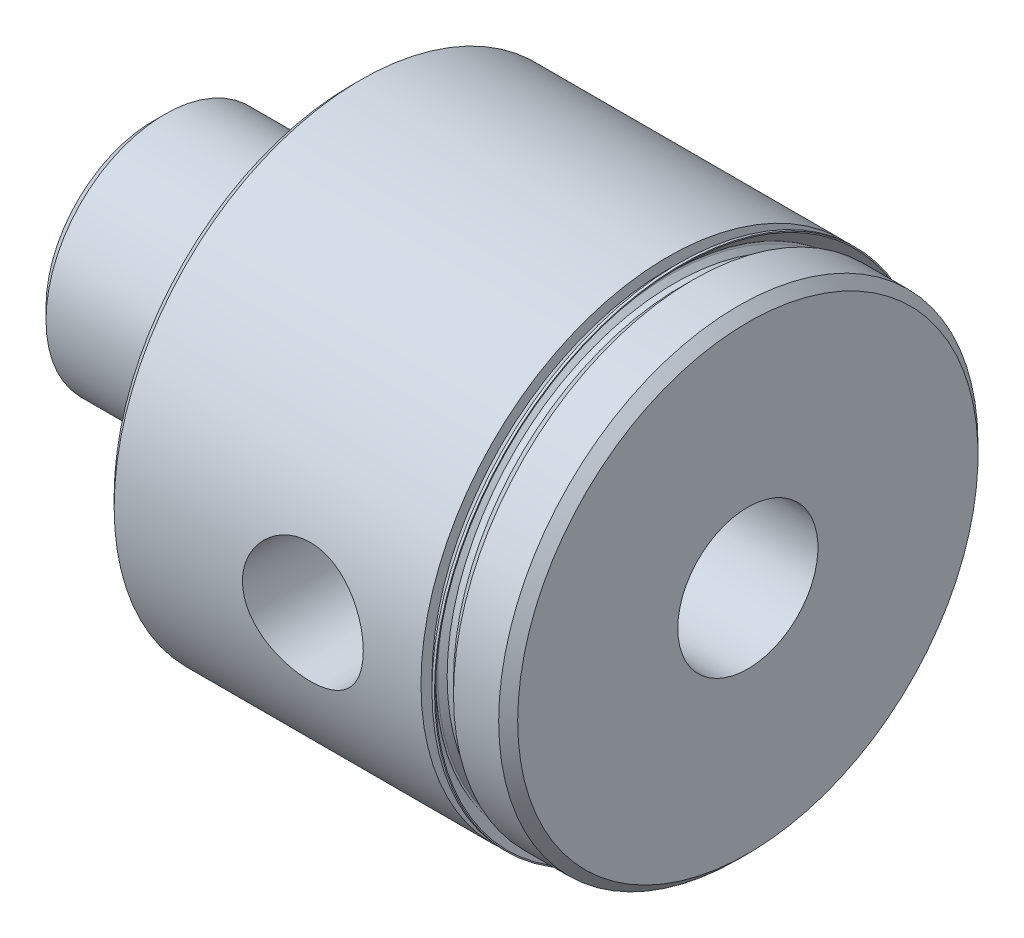
ISO-10303-21;
HEADER;
FILE_DESCRIPTION(('STEP AP214'),'2;1');
FILE_NAME('part.step','',(''),(''),'','','');
FILE_SCHEMA(('AUTOMOTIVE_DESIGN { 1 0 10303 214 1 1 1 1 }'));
ENDSEC;
DATA;
#1=APPLICATION_CONTEXT('core data for automotive mechanical design processes');
#2=APPLICATION_PROTOCOL_DEFINITION('international standard','automotive_design',2000,#1);
#3=PRODUCT_CONTEXT('',#1,'mechanical');
#4=PRODUCT('Part','Part','',(#3));
#5=PRODUCT_RELATED_PRODUCT_CATEGORY('part','',(#4));
#6=PRODUCT_DEFINITION_FORMATION('','',#4);
#7=PRODUCT_DEFINITION_CONTEXT('part definition',#1,'design');
#8=PRODUCT_DEFINITION('design','',#6,#7);
#9=PRODUCT_DEFINITION_SHAPE('','',#8);
#10=(LENGTH_UNIT() NAMED_UNIT(*) SI_UNIT(.MILLI.,.METRE.));
#11=(NAMED_UNIT(*) PLANE_ANGLE_UNIT() SI_UNIT($,.RADIAN.));
#12=(NAMED_UNIT(*) SI_UNIT($,.STERADIAN.) SOLID_ANGLE_UNIT());
#13=UNCERTAINTY_MEASURE_WITH_UNIT(LENGTH_MEASURE(1.E-05),#10,'distance_accuracy_value','');
#14=(GEOMETRIC_REPRESENTATION_CONTEXT(3) GLOBAL_UNCERTAINTY_ASSIGNED_CONTEXT((#13)) GLOBAL_UNIT_ASSIGNED_CONTEXT((#10,
#11,#12)) REPRESENTATION_CONTEXT('',''));
#15=CARTESIAN_POINT('',(0.,0.,0.));
#16=DIRECTION('',(0.,0.,1.));
#17=DIRECTION('',(1.,0.,0.));
#18=AXIS2_PLACEMENT_3D('',#15,#16,#17);
#19=CARTESIAN_POINT('',(41.2115,19.76755,0.));
#20=DIRECTION('',(-1.,0.,0.));
#21=DIRECTION('',(0.,0.,1.));
#22=AXIS2_PLACEMENT_3D('',#19,#20,#21);
#23=PLANE('',#22);
#24=CARTESIAN_POINT('',(41.2115,0.,0.));
#25=DIRECTION('',(-1.,0.,0.));
#26=DIRECTION('',(0.,0.,1.));
#27=AXIS2_PLACEMENT_3D('',#24,#25,#26);
#28=CIRCLE('',#27,19.76755);
#29=CARTESIAN_POINT('',(41.2115,0.,19.76755));
#30=VERTEX_POINT('',#29);
#31=EDGE_CURVE('E123',#30,#30,#28,.T.);
#32=ORIENTED_EDGE('',*,*,#31,.F.);
#33=EDGE_LOOP('',(#32));
#34=FACE_BOUND('',#33,.T.);
#35=CARTESIAN_POINT('',(41.2115,0.,0.));
#36=DIRECTION('',(-1.,0.,0.));
#37=DIRECTION('',(0.,0.,1.));
#38=AXIS2_PLACEMENT_3D('',#35,#36,#37);
#39=CIRCLE('',#38,18.888259175245);
#40=CARTESIAN_POINT('',(41.2115,0.,18.888259175245));
#41=VERTEX_POINT('',#40);
#42=EDGE_CURVE('E10',#41,#41,#39,.F.);
#43=ORIENTED_EDGE('',*,*,#42,.F.);
#44=EDGE_LOOP('',(#43));
#45=FACE_BOUND('',#44,.T.);
#46=ADVANCED_FACE('F40',(#34,#45),#23,.F.);
#47=CARTESIAN_POINT('',(47.625,0.,0.));
#48=DIRECTION('',(-1.,0.,0.));
#49=DIRECTION('',(0.,0.,1.));
#50=AXIS2_PLACEMENT_3D('',#47,#48,#49);
#51=CYLINDRICAL_SURFACE('',#50,18.18005);
#52=CARTESIAN_POINT('',(42.2275,0.,0.));
#53=DIRECTION('',(-1.,0.,0.));
#54=DIRECTION('',(0.,0.,1.));
#55=AXIS2_PLACEMENT_3D('',#52,#53,#54);
#56=CIRCLE('',#55,18.18005);
#57=CARTESIAN_POINT('',(42.2275,0.,18.18005));
#58=VERTEX_POINT('',#57);
#59=EDGE_CURVE('E126',#58,#58,#56,.T.);
#60=ORIENTED_EDGE('',*,*,#59,.T.);
#61=EDGE_LOOP('',(#60));
#62=FACE_BOUND('',#61,.T.);
#63=CARTESIAN_POINT('',(41.7195,0.,0.));
#64=DIRECTION('',(-1.,0.,0.));
#65=DIRECTION('',(0.,0.,1.));
#66=AXIS2_PLACEMENT_3D('',#63,#64,#65);
#67=CIRCLE('',#66,18.18005);
#68=CARTESIAN_POINT('',(41.7195,0.,18.18005));
#69=VERTEX_POINT('',#68);
#70=EDGE_CURVE('E47',#69,#69,#67,.T.);
#71=ORIENTED_EDGE('',*,*,#70,.F.);
#72=EDGE_LOOP('',(#71));
#73=FACE_BOUND('',#72,.T.);
#74=ADVANCED_FACE('F113',(#62,#73),#51,.T.);
#75=CARTESIAN_POINT('',(47.625,0.,0.));
#76=DIRECTION('',(-1.,0.,0.));
#77=DIRECTION('',(0.,0.,1.));
#78=AXIS2_PLACEMENT_3D('',#75,#76,#77);
#79=CYLINDRICAL_SURFACE('',#78,19.76755);
#80=CARTESIAN_POINT('',(16.637,0.,0.));
#81=DIRECTION('',(-1.,0.,0.));
#82=DIRECTION('',(0.,0.,1.));
#83=AXIS2_PLACEMENT_3D('',#80,#81,#82);
#84=CIRCLE('',#83,19.76755);
#85=CARTESIAN_POINT('',(16.637,0.,19.76755));
#86=VERTEX_POINT('',#85);
#87=EDGE_CURVE('E125',#86,#86,#84,.T.);
#88=ORIENTED_EDGE('',*,*,#87,.F.);
#89=EDGE_LOOP('',(#88));
#90=FACE_BOUND('',#89,.T.);
#91=ORIENTED_EDGE('',*,*,#31,.T.);
#92=EDGE_LOOP('',(#91));
#93=FACE_BOUND('',#92,.T.);
#94=CARTESIAN_POINT('',(28.435365081816,-3.51265650317575,19.4529503493223));
#95=CARTESIAN_POINT('',(28.6329278280783,-3.69763911428528,19.4195484578315));
#96=CARTESIAN_POINT('',(28.8461523832951,-3.8660805131461,19.3864045251385));
#97=CARTESIAN_POINT('',(29.2982767694255,-4.16526039848003,19.3243394024906));
#98=CARTESIAN_POINT('',(29.5371903557272,-4.29597854636476,19.2954204946016));
#99=CARTESIAN_POINT('',(30.0344111976161,-4.51592878148575,19.2451350457812));
#100=CARTESIAN_POINT('',(30.2927327479368,-4.60512993491552,19.2237741390568));
#101=CARTESIAN_POINT('',(30.8212362958428,-4.73902603586449,19.1912083718852));
#102=CARTESIAN_POINT('',(31.091414940882,-4.78373348022602,19.1800006598137));
#103=CARTESIAN_POINT('',(31.630627161756,-4.82676103183334,19.1692174197079));
#104=CARTESIAN_POINT('',(31.8995893709715,-4.82592441675557,19.1694304285267));
#105=CARTESIAN_POINT('',(32.4334566613178,-4.77998645132883,19.1809360417537));
#106=CARTESIAN_POINT('',(32.6983617925494,-4.73488564804683,19.1922285092294));
#107=CARTESIAN_POINT('',(33.2141373097179,-4.60252491595889,19.2243941628857));
#108=CARTESIAN_POINT('',(33.4651152033048,-4.5156604777289,19.2451773832846));
#109=CARTESIAN_POINT('',(33.9489993997335,-4.3025515462851,19.2939361087814));
#110=CARTESIAN_POINT('',(34.1819033976118,-4.17630204056709,19.321912529272));
#111=CARTESIAN_POINT('',(34.6282945618301,-3.88488055179608,19.3826282081787));
#112=CARTESIAN_POINT('',(34.8412767286942,-3.71895317869879,19.415454475128));
#113=CARTESIAN_POINT('',(35.2366729936586,-3.35406634411163,19.4818015571243));
#114=CARTESIAN_POINT('',(35.4190833363315,-3.15510283044633,19.5153224569323));
#115=CARTESIAN_POINT('',(35.7511715111366,-2.72568801269662,19.5799514409178));
#116=CARTESIAN_POINT('',(35.9002527135169,-2.49476691186133,19.611009962086));
#117=CARTESIAN_POINT('',(36.1572439441031,-2.01031843546389,19.6665706414187));
#118=CARTESIAN_POINT('',(36.2651587711716,-1.756793699115,19.6910735636855));
#119=CARTESIAN_POINT('',(36.4349032225895,-1.23859032196555,19.7303904621238));
#120=CARTESIAN_POINT('',(36.4974498136582,-0.974158321983477,19.7453546987443));
#121=CARTESIAN_POINT('',(36.5771093875624,-0.43817138420285,19.7645106115859));
#122=CARTESIAN_POINT('',(36.5942308239995,-0.166617781232319,19.7687042921982));
#123=CARTESIAN_POINT('',(36.5826094638717,0.368142985725246,19.7658827120028));
#124=CARTESIAN_POINT('',(36.5550815152975,0.631379071573977,19.7591643460427));
#125=CARTESIAN_POINT('',(36.4573784979057,1.1493417179025,19.7358121128105));
#126=CARTESIAN_POINT('',(36.3872032393555,1.40406824051897,19.7191782014254));
#127=CARTESIAN_POINT('',(36.20639161497,1.89822862606427,19.677762892548));
#128=CARTESIAN_POINT('',(36.0957215972578,2.13764957483144,19.6529747204527));
#129=CARTESIAN_POINT('',(35.837207806796,2.59480171047055,19.5978601353498));
#130=CARTESIAN_POINT('',(35.6893581937111,2.81252948217283,19.5675328524392));
#131=CARTESIAN_POINT('',(35.356034329401,3.22643047339813,19.5036218391906));
#132=CARTESIAN_POINT('',(35.1696504349527,3.42186124178595,19.4699722082067));
#133=CARTESIAN_POINT('',(34.7668632401047,3.77912170302543,19.4037975687667));
#134=CARTESIAN_POINT('',(34.5504563796814,3.94094740540965,19.3712726942526));
#135=CARTESIAN_POINT('',(34.0895860496967,4.22894103774358,19.3104679954526));
#136=CARTESIAN_POINT('',(33.8447283307059,4.3544955777866,19.2822646045092));
#137=CARTESIAN_POINT('',(33.3366256252978,4.56262704775068,19.2340833038405));
#138=CARTESIAN_POINT('',(33.0733832244848,4.64521000740383,19.2141042401674));
#139=CARTESIAN_POINT('',(32.5406394056792,4.76371146458682,19.1850666945539));
#140=CARTESIAN_POINT('',(32.2713163473849,4.80038744704197,19.1758311259643));
#141=CARTESIAN_POINT('',(31.7301931801441,4.82834722752884,19.1688112712599));
#142=CARTESIAN_POINT('',(31.4583934012672,4.81963698830482,19.1710254808974));
#143=CARTESIAN_POINT('',(30.9258578691795,4.75777986051021,19.1864668890865));
#144=CARTESIAN_POINT('',(30.6650095220289,4.70553893930104,19.1994695336789));
#145=CARTESIAN_POINT('',(30.1558920557396,4.55946875033867,19.2346788846883));
#146=CARTESIAN_POINT('',(29.9076238683241,4.46563640720602,19.2568862717203));
#147=CARTESIAN_POINT('',(29.4277871838305,4.2379864197375,19.3082674520253));
#148=CARTESIAN_POINT('',(29.1964171578653,4.10376666251472,19.3375106807538));
#149=CARTESIAN_POINT('',(28.7591799812249,3.79940157683792,19.3996041291334));
#150=CARTESIAN_POINT('',(28.5533168737152,3.62925056436098,19.4324549190753));
#151=CARTESIAN_POINT('',(28.1678199863334,3.25295244141874,19.499016030879));
#152=CARTESIAN_POINT('',(27.9889295753611,3.04604306859441,19.5327281525631));
#153=CARTESIAN_POINT('',(27.6684203590344,2.60460345340952,19.5964722725483));
#154=CARTESIAN_POINT('',(27.526801331945,2.37007337538216,19.6265042927425));
#155=CARTESIAN_POINT('',(27.2853814922027,1.88028127444305,19.6794573161784));
#156=CARTESIAN_POINT('',(27.1854868457201,1.62506732901444,19.7023942450575));
#157=CARTESIAN_POINT('',(27.0303815768316,1.10076483356896,19.7386246450477));
#158=CARTESIAN_POINT('',(26.9751611196866,0.831679351165157,19.7519202385707));
#159=CARTESIAN_POINT('',(26.9122213961598,0.295282285694851,19.7671149914487));
#160=CARTESIAN_POINT('',(26.9032268815798,0.0281285750742939,19.7693200706738));
#161=CARTESIAN_POINT('',(26.9296091709244,-0.50385988489081,19.7629175554801));
#162=CARTESIAN_POINT('',(26.9649869116482,-0.768694585156912,19.7543097327762));
#163=CARTESIAN_POINT('',(27.0781356723665,-1.28492103944122,19.7274177433937));
#164=CARTESIAN_POINT('',(27.1553431250623,-1.5364437690449,19.7092623041115));
#165=CARTESIAN_POINT('',(27.3493194364399,-2.02291155997901,19.6652868574562));
#166=CARTESIAN_POINT('',(27.4660727854644,-2.25786307685637,19.6394698553918));
#167=CARTESIAN_POINT('',(27.71549644764,-2.67173781743904,19.5871061222848));
#168=CARTESIAN_POINT('',(27.8431733101079,-2.85378481366746,19.5612462333185));
#169=CARTESIAN_POINT('',(28.122183547356,-3.19847479248924,19.5078500664681));
#170=CARTESIAN_POINT('',(28.2735189032132,-3.3611161481115,19.4803136483155));
#171=CARTESIAN_POINT('',(28.435365081816,-3.51265650317575,19.4529503493223));
#172=B_SPLINE_CURVE_WITH_KNOTS('',3,(#94,#95,#96,#97,#98,#99,#100,#101,#102,#103,#104,#105,#106,
#107,#108,#109,#110,#111,#112,#113,#114,#115,#116,#117,#118,#119,#120,#121,#122,#123,#124,#125,
#126,#127,#128,#129,#130,#131,#132,#133,#134,#135,#136,#137,#138,#139,#140,#141,#142,#143,#144,
#145,#146,#147,#148,#149,#150,#151,#152,#153,#154,#155,#156,#157,#158,#159,#160,#161,#162,#163,
#164,#165,#166,#167,#168,#169,#170,#171),.UNSPECIFIED.,.T.,.F.,(4,2,2,2,2,2,2,2,2,2,2,2,2,2,2,2,
2,2,2,2,2,2,2,2,2,2,2,2,2,2,2,2,2,2,2,2,2,2,4),(0.,0.817314073620869,1.63506798447687,
2.4534302222361,3.27156254361548,4.07455186240763,4.8775312570733,5.67305209525232,
6.46867422002776,7.28085528321948,8.09313604130971,8.91896356729549,9.74469479515468,
10.5570742328157,11.369302476408,12.1597994363369,12.9502999131154,13.7414588075947,
14.532742058532,15.3454316232512,16.1582176364985,16.9840368466382,17.8097401473271,
18.6216312588531,19.4334157085595,20.2287152433845,21.0240735945681,21.8276287134212,
22.6313110432991,23.4541767979964,24.2770376571882,25.0980378916828,25.918857338973,
26.7169061884853,27.5149718869051,28.3025434253844,29.0898064401128,29.7593055255743,
30.4288607025318),.UNSPECIFIED.);
#173=CARTESIAN_POINT('',(28.435365081816,-3.51265650317575,19.4529503493223));
#174=VERTEX_POINT('',#173);
#175=EDGE_CURVE('E51',#174,#174,#172,.T.);
#176=ORIENTED_EDGE('',*,*,#175,.F.);
#177=EDGE_LOOP('',(#176));
#178=FACE_BOUND('',#177,.T.);
#179=ADVANCED_FACE('F68',(#90,#93,#178),#79,.T.);
#180=CARTESIAN_POINT('',(0.,0.,0.));
#181=DIRECTION('',(-1.,0.,0.));
#182=DIRECTION('',(0.,0.,1.));
#183=AXIS2_PLACEMENT_3D('',#180,#181,#182);
#184=CYLINDRICAL_SURFACE('',#183,5.6134);
#185=CARTESIAN_POINT('',(0.761999999999985,0.,0.));
#186=DIRECTION('',(-1.,0.,0.));
#187=DIRECTION('',(0.,0.,1.));
#188=AXIS2_PLACEMENT_3D('',#185,#186,#187);
#189=CIRCLE('',#188,5.61340000000001);
#190=CARTESIAN_POINT('',(0.761999999999985,0.,5.61340000000001));
#191=VERTEX_POINT('',#190);
#192=EDGE_CURVE('E498',#191,#191,#189,.T.);
#193=ORIENTED_EDGE('',*,*,#192,.T.);
#194=EDGE_LOOP('',(#193));
#195=FACE_BOUND('',#194,.T.);
#196=CARTESIAN_POINT('',(47.625,0.,0.));
#197=DIRECTION('',(-1.,0.,0.));
#198=DIRECTION('',(0.,0.,1.));
#199=AXIS2_PLACEMENT_3D('',#196,#197,#198);
#200=CIRCLE('',#199,5.6134);
#201=CARTESIAN_POINT('',(47.625,0.,5.6134));
#202=VERTEX_POINT('',#201);
#203=EDGE_CURVE('E501',#202,#202,#200,.T.);
#204=ORIENTED_EDGE('',*,*,#203,.F.);
#205=EDGE_LOOP('',(#204));
#206=FACE_BOUND('',#205,.T.);
#207=CARTESIAN_POINT('',(34.925,0.,5.6134));
#208=CARTESIAN_POINT('',(34.9249998579023,-0.0821623693349804,5.61339995699838));
#209=CARTESIAN_POINT('',(34.9218051359041,-0.164320513889019,5.61159065214013));
#210=CARTESIAN_POINT('',(34.9090814661473,-0.327995279330299,5.60440967825438));
#211=CARTESIAN_POINT('',(34.8995504492879,-0.409511681857266,5.59903684556736));
#212=CARTESIAN_POINT('',(34.8616097743609,-0.652081627692676,5.57774779539358));
#213=CARTESIAN_POINT('',(34.8238521366127,-0.811338029816947,5.55666060930794));
#214=CARTESIAN_POINT('',(34.7254246715626,-1.1196591009717,5.50282798498081));
#215=CARTESIAN_POINT('',(34.6648395967703,-1.2687590894302,5.47012569612708));
#216=CARTESIAN_POINT('',(34.5230636232286,-1.55440526348606,5.39591227930169));
#217=CARTESIAN_POINT('',(34.4418675936104,-1.69094831162539,5.35439895834356));
#218=CARTESIAN_POINT('',(34.2547143605698,-1.95845765966252,5.26270844927263));
#219=CARTESIAN_POINT('',(34.1474069572226,-2.08833692764613,5.21212508879653));
#220=CARTESIAN_POINT('',(33.9140569239964,-2.32930354211221,5.10899359943268));
#221=CARTESIAN_POINT('',(33.7879945230462,-2.44037078994657,5.05644344148403));
#222=CARTESIAN_POINT('',(33.504882480484,-2.65245775268943,4.94876899543654));
#223=CARTESIAN_POINT('',(33.3459646844461,-2.7511649183057,4.89396219071688));
#224=CARTESIAN_POINT('',(33.0106076339825,-2.92003380267968,4.79513183911936));
#225=CARTESIAN_POINT('',(32.8341947885826,-2.99023775531915,4.75109237682188));
#226=CARTESIAN_POINT('',(32.5081085203762,-3.08677877117435,4.68877513505459));
#227=CARTESIAN_POINT('',(32.3609482301036,-3.11933139320781,4.66697971465573));
#228=CARTESIAN_POINT('',(32.062174173554,-3.16321149440601,4.63735760926831));
#229=CARTESIAN_POINT('',(31.9105651976561,-3.17456101071162,4.62951642155263));
#230=CARTESIAN_POINT('',(31.6070694166165,-3.17541450648967,4.62893102770911));
#231=CARTESIAN_POINT('',(31.4551825021945,-3.16489092366436,4.63620586929009));
#232=CARTESIAN_POINT('',(31.1557383283429,-3.12255993267885,4.66481557633946));
#233=CARTESIAN_POINT('',(31.0081840539181,-3.09073819423309,4.68615990820008));
#234=CARTESIAN_POINT('',(30.7213592656859,-3.00745687900315,4.74002995044834));
#235=CARTESIAN_POINT('',(30.5820705370745,-2.95604248858711,4.77252991570124));
#236=CARTESIAN_POINT('',(30.3136541723933,-2.83535200958952,4.84520308215602));
#237=CARTESIAN_POINT('',(30.1845304845011,-2.76606902495452,4.88537924428915));
#238=CARTESIAN_POINT('',(29.9185539754628,-2.59900192815599,4.97652910443213));
#239=CARTESIAN_POINT('',(29.7836777474499,-2.49844939981214,5.02820730750219));
#240=CARTESIAN_POINT('',(29.531461845307,-2.27747390969321,5.13208771183061));
#241=CARTESIAN_POINT('',(29.4141368708698,-2.15703446766699,5.18429031367501));
#242=CARTESIAN_POINT('',(29.1874224378805,-1.88376954375588,5.29011416577329));
#243=CARTESIAN_POINT('',(29.0802977235085,-1.72884386148078,5.34326809463977));
#244=CARTESIAN_POINT('',(28.94070761533,-1.48238030822901,5.41481160729083));
#245=CARTESIAN_POINT('',(28.8976811279881,-1.39784437015664,5.43730202634795));
#246=CARTESIAN_POINT('',(28.8191226254188,-1.22458602807581,5.47891971352667));
#247=CARTESIAN_POINT('',(28.783586095122,-1.13586618589834,5.49804900662658));
#248=CARTESIAN_POINT('',(28.7226722308014,-0.961180402024894,5.53116102266396));
#249=CARTESIAN_POINT('',(28.696761149947,-0.87545038183479,5.54540871504812));
#250=CARTESIAN_POINT('',(28.6521959792515,-0.701626536182391,5.57006998084775));
#251=CARTESIAN_POINT('',(28.6335380099381,-0.613534001388016,5.58048560376228));
#252=CARTESIAN_POINT('',(28.6037525571766,-0.435737446747216,5.59717370826138));
#253=CARTESIAN_POINT('',(28.5926210004367,-0.346034325578979,5.60344843085562));
#254=CARTESIAN_POINT('',(28.5780437509341,-0.16583998266467,5.61167630889778));
#255=CARTESIAN_POINT('',(28.5745972374804,-0.075348846107521,5.61362992579932));
#256=CARTESIAN_POINT('',(28.5758093772984,0.17458399688907,5.61293847555329));
#257=CARTESIAN_POINT('',(28.5886358891678,0.334071783644838,5.60566022957548));
#258=CARTESIAN_POINT('',(28.6377820254482,0.648103262439577,5.57809452559715));
#259=CARTESIAN_POINT('',(28.674102193285,0.802646840028517,5.55780676667696));
#260=CARTESIAN_POINT('',(28.7681869112593,1.10172711361315,5.50629732611813));
#261=CARTESIAN_POINT('',(28.8257832746561,1.24633201539081,5.4751615044649));
#262=CARTESIAN_POINT('',(28.9603655920564,1.52393967562467,5.40448155117352));
#263=CARTESIAN_POINT('',(29.037356403376,1.65693951635579,5.36493531354388));
#264=CARTESIAN_POINT('',(29.2175639746098,1.92243070943738,5.27599210831586));
#265=CARTESIAN_POINT('',(29.322673637778,2.05343578030353,5.22599869425569));
#266=CARTESIAN_POINT('',(29.5516887816742,2.29696386299473,5.12364194197684));
#267=CARTESIAN_POINT('',(29.6756155030866,2.40946568556823,5.07127597308857));
#268=CARTESIAN_POINT('',(29.9544974447345,2.625094802698,4.96338330060658));
#269=CARTESIAN_POINT('',(30.1113564524656,2.72591153444098,4.90812262432983));
#270=CARTESIAN_POINT('',(30.4428125411621,2.89944000724207,4.80766134429478));
#271=CARTESIAN_POINT('',(30.6173849857137,2.97219012547718,4.76244703968003));
#272=CARTESIAN_POINT('',(30.9415942277655,3.07401157882498,4.69718724903206));
#273=CARTESIAN_POINT('',(31.0886836484926,3.10906992450446,4.67383958626922));
#274=CARTESIAN_POINT('',(31.3878077894682,3.15790146031213,4.64099309224391));
#275=CARTESIAN_POINT('',(31.5398369506483,3.17169778517904,4.63147920938678));
#276=CARTESIAN_POINT('',(31.8447547230325,3.17725338732108,4.62767071186645));
#277=CARTESIAN_POINT('',(31.9976443607764,3.16897484778946,4.63340221427745));
#278=CARTESIAN_POINT('',(32.2994761100531,3.13079490920484,4.65927981058093));
#279=CARTESIAN_POINT('',(32.448415640636,3.10087971711801,4.67943509932923));
#280=CARTESIAN_POINT('',(32.7368248367288,3.02141291547972,4.73112132971287));
#281=CARTESIAN_POINT('',(32.8763856719801,2.97209774057715,4.76251490624142));
#282=CARTESIAN_POINT('',(33.1456249813082,2.8555915344253,4.83326937464132));
#283=CARTESIAN_POINT('',(33.2752997080469,2.78839376767878,4.87263326720189));
#284=CARTESIAN_POINT('',(33.5422084997231,2.62613578705629,4.96220653197006));
#285=CARTESIAN_POINT('',(33.677561882322,2.52838526398892,5.01315372940073));
#286=CARTESIAN_POINT('',(33.9312040900675,2.31315811275706,5.11603656683269));
#287=CARTESIAN_POINT('',(34.0494788070713,2.1956653475302,5.16797298436634));
#288=CARTESIAN_POINT('',(34.2796251062276,1.92775741716748,5.27418452421595));
#289=CARTESIAN_POINT('',(34.3891364595098,1.77509997176914,5.3280246204245));
#290=CARTESIAN_POINT('',(34.5326571593358,1.53177908465099,5.4010314552227));
#291=CARTESIAN_POINT('',(34.5770561452431,1.44823905178625,5.42408413489764));
#292=CARTESIAN_POINT('',(34.6584746076697,1.27686406563405,5.4669604093337));
#293=CARTESIAN_POINT('',(34.6954983511241,1.18903163255535,5.48678586997627));
#294=CARTESIAN_POINT('',(34.7606515248021,1.01251042042715,5.52204053165217));
#295=CARTESIAN_POINT('',(34.7890232695167,0.923934681391814,5.53758800601035));
#296=CARTESIAN_POINT('',(34.8379811829612,0.744093029789213,5.56460645282066));
#297=CARTESIAN_POINT('',(34.8585716140312,0.652828619605575,5.5760796568118));
#298=CARTESIAN_POINT('',(34.891646678541,0.46845248086365,5.59458580978862));
#299=CARTESIAN_POINT('',(34.9041361845415,0.375341897546175,5.60162142783206));
#300=CARTESIAN_POINT('',(34.9208123777646,0.188152276859621,5.61102823921541));
#301=CARTESIAN_POINT('',(34.9250001626974,0.0940733691828538,5.61340004923552));
#302=CARTESIAN_POINT('',(34.925,0.,5.6134));
#303=B_SPLINE_CURVE_WITH_KNOTS('',3,(#207,#208,#209,#210,#211,#212,#213,#214,#215,#216,#217,
#218,#219,#220,#221,#222,#223,#224,#225,#226,#227,#228,#229,#230,#231,#232,#233,#234,#235,#236,
#237,#238,#239,#240,#241,#242,#243,#244,#245,#246,#247,#248,#249,#250,#251,#252,#253,#254,#255,
#256,#257,#258,#259,#260,#261,#262,#263,#264,#265,#266,#267,#268,#269,#270,#271,#272,#273,#274,
#275,#276,#277,#278,#279,#280,#281,#282,#283,#284,#285,#286,#287,#288,#289,#290,#291,#292,#293,
#294,#295,#296,#297,#298,#299,#300,#301,#302),.UNSPECIFIED.,.T.,.F.,(4,2,2,2,2,2,2,2,2,2,2,2,2,
2,2,2,2,2,2,2,2,2,2,2,2,2,2,2,2,2,2,2,2,2,2,2,2,2,2,2,2,2,2,2,2,2,2,4),(0.,0.246389107575224,
0.49285871242746,0.985259173450996,1.47584920765582,1.96656148878411,2.49216874007467,
3.01833405240715,3.60026598356831,4.18133247771155,4.6362086725214,5.09061183476255,
5.54558793766705,6.00087047559118,6.45510929250011,6.90952367749083,7.43538208138259,
7.96167847067522,8.54543274549417,8.83753694560908,9.12946455367089,9.40114046431933,
9.67267086306319,9.94405419177241,10.2154085378833,10.693342364036,11.1712872455506,
11.6455321524318,12.1198959516685,12.643507174172,13.1677139040996,13.7483150461528,
14.3281194593634,14.7851501714349,15.2416832464326,15.6989989178594,16.1566063782507,
16.608801484326,17.061167151824,17.5827687787249,18.1047988489815,18.6877837852989,
18.9795590964415,19.2711651080098,19.5536352357359,19.8359504108384,20.118095620585,
20.4002035206756),.UNSPECIFIED.);
#304=CARTESIAN_POINT('',(34.925,0.,5.6134));
#305=VERTEX_POINT('',#304);
#306=EDGE_CURVE('E62',#305,#305,#303,.T.);
#307=ORIENTED_EDGE('',*,*,#306,.F.);
#308=EDGE_LOOP('',(#307));
#309=FACE_BOUND('',#308,.T.);
#310=ADVANCED_FACE('F92',(#195,#206,#309),#184,.F.);
#311=CARTESIAN_POINT('',(15.875,0.,0.));
#312=DIRECTION('',(-1.,0.,0.));
#313=DIRECTION('',(0.,0.,1.));
#314=AXIS2_PLACEMENT_3D('',#311,#312,#313);
#315=CYLINDRICAL_SURFACE('',#314,9.49325);
#316=CARTESIAN_POINT('',(13.4874,0.,0.));
#317=DIRECTION('',(-1.,0.,0.));
#318=DIRECTION('',(0.,0.,1.));
#319=AXIS2_PLACEMENT_3D('',#316,#317,#318);
#320=CIRCLE('',#319,9.49325);
#321=CARTESIAN_POINT('',(13.4874,0.,9.49325));
#322=VERTEX_POINT('',#321);
#323=EDGE_CURVE('E55',#322,#322,#320,.T.);
#324=ORIENTED_EDGE('',*,*,#323,.F.);
#325=EDGE_LOOP('',(#324));
#326=FACE_BOUND('',#325,.T.);
#327=CARTESIAN_POINT('',(15.875,0.,0.));
#328=DIRECTION('',(1.,0.,0.));
#329=DIRECTION('',(0.,0.,-1.));
#330=AXIS2_PLACEMENT_3D('',#327,#328,#329);
#331=CIRCLE('',#330,9.49325);
#332=CARTESIAN_POINT('',(15.875,0.,-9.49325));
#333=VERTEX_POINT('',#332);
#334=EDGE_CURVE('E138',#333,#333,#331,.T.);
#335=ORIENTED_EDGE('',*,*,#334,.F.);
#336=EDGE_LOOP('',(#335));
#337=FACE_BOUND('',#336,.T.);
#338=ADVANCED_FACE('F42',(#326,#337),#315,.T.);
#339=CARTESIAN_POINT('',(13.4874,9.41705,0.));
#340=DIRECTION('',(1.,0.,0.));
#341=DIRECTION('',(0.,0.,-1.));
#342=AXIS2_PLACEMENT_3D('',#339,#340,#341);
#343=PLANE('',#342);
#344=CARTESIAN_POINT('',(13.4874,0.,0.));
#345=DIRECTION('',(-1.,0.,0.));
#346=DIRECTION('',(0.,0.,1.));
#347=AXIS2_PLACEMENT_3D('',#344,#345,#346);
#348=CIRCLE('',#347,9.41705);
#349=CARTESIAN_POINT('',(13.4874,0.,9.41705));
#350=VERTEX_POINT('',#349);
#351=EDGE_CURVE('E159',#350,#350,#348,.T.);
#352=ORIENTED_EDGE('',*,*,#351,.F.);
#353=EDGE_LOOP('',(#352));
#354=FACE_BOUND('',#353,.T.);
#355=ORIENTED_EDGE('',*,*,#323,.T.);
#356=EDGE_LOOP('',(#355));
#357=FACE_BOUND('',#356,.T.);
#358=ADVANCED_FACE('F164',(#354,#357),#343,.F.);
#359=CARTESIAN_POINT('',(12.3697999999999,0.,0.));
#360=DIRECTION('',(-1.,0.,0.));
#361=DIRECTION('',(0.,0.,1.));
#362=AXIS2_PLACEMENT_3D('',#359,#360,#361);
#363=TOROIDAL_SURFACE('',#362,9.41705000000012,1.11760000000012);
#364=CARTESIAN_POINT('',(12.3698,0.,0.));
#365=DIRECTION('',(-1.,0.,0.));
#366=DIRECTION('',(0.,0.,1.));
#367=AXIS2_PLACEMENT_3D('',#364,#365,#366);
#368=CIRCLE('',#367,8.29945);
#369=CARTESIAN_POINT('',(12.3698,0.,8.29945));
#370=VERTEX_POINT('',#369);
#371=EDGE_CURVE('E156',#370,#370,#368,.T.);
#372=ORIENTED_EDGE('',*,*,#371,.F.);
#373=EDGE_LOOP('',(#372));
#374=FACE_BOUND('',#373,.T.);
#375=ORIENTED_EDGE('',*,*,#351,.T.);
#376=EDGE_LOOP('',(#375));
#377=FACE_BOUND('',#376,.T.);
#378=ADVANCED_FACE('F202',(#374,#377),#363,.F.);
#379=CARTESIAN_POINT('',(15.875,0.,0.));
#380=DIRECTION('',(-1.,0.,0.));
#381=DIRECTION('',(0.,0.,1.));
#382=AXIS2_PLACEMENT_3D('',#379,#380,#381);
#383=CYLINDRICAL_SURFACE('',#382,8.29945);
#384=CARTESIAN_POINT('',(11.0362999999995,0.,0.));
#385=DIRECTION('',(-1.,0.,0.));
#386=DIRECTION('',(0.,0.,1.));
#387=AXIS2_PLACEMENT_3D('',#384,#385,#386);
#388=CIRCLE('',#387,8.29945);
#389=CARTESIAN_POINT('',(11.0362999999995,0.,8.29945));
#390=VERTEX_POINT('',#389);
#391=EDGE_CURVE('E153',#390,#390,#388,.T.);
#392=ORIENTED_EDGE('',*,*,#391,.F.);
#393=EDGE_LOOP('',(#392));
#394=FACE_BOUND('',#393,.T.);
#395=ORIENTED_EDGE('',*,*,#371,.T.);
#396=EDGE_LOOP('',(#395));
#397=FACE_BOUND('',#396,.T.);
#398=ADVANCED_FACE('F198',(#394,#397),#383,.T.);
#399=CARTESIAN_POINT('',(11.0362999999995,0.,0.));
#400=DIRECTION('',(-1.,0.,0.));
#401=DIRECTION('',(0.,0.,1.));
#402=AXIS2_PLACEMENT_3D('',#399,#400,#401);
#403=TOROIDAL_SURFACE('',#402,9.41704999999865,1.11759999999865);
#404=CARTESIAN_POINT('',(10.2623331868814,0.,0.));
#405=DIRECTION('',(-1.,0.,0.));
#406=DIRECTION('',(0.,0.,1.));
#407=AXIS2_PLACEMENT_3D('',#404,#405,#406);
#408=CIRCLE('',#407,8.6108210423267);
#409=CARTESIAN_POINT('',(10.2623331868814,0.,8.6108210423267));
#410=VERTEX_POINT('',#409);
#411=EDGE_CURVE('E150',#410,#410,#408,.T.);
#412=ORIENTED_EDGE('',*,*,#411,.F.);
#413=EDGE_LOOP('',(#412));
#414=FACE_BOUND('',#413,.T.);
#415=ORIENTED_EDGE('',*,*,#391,.T.);
#416=EDGE_LOOP('',(#415));
#417=FACE_BOUND('',#416,.T.);
#418=ADVANCED_FACE('F194',(#414,#417),#403,.F.);
#419=CARTESIAN_POINT('',(10.2623331868814,0.,0.));
#420=DIRECTION('',(-1.,0.,0.));
#421=DIRECTION('',(0.,0.,1.));
#422=AXIS2_PLACEMENT_3D('',#419,#420,#421);
#423=CONICAL_SURFACE('',#422,8.6108210423267,0.764984450361304);
#424=CARTESIAN_POINT('',(9.3100474613459,0.,0.));
#425=DIRECTION('',(-1.,0.,0.));
#426=DIRECTION('',(0.,0.,1.));
#427=AXIS2_PLACEMENT_3D('',#424,#425,#426);
#428=CIRCLE('',#427,9.525);
#429=CARTESIAN_POINT('',(9.3100474613459,0.,9.525));
#430=VERTEX_POINT('',#429);
#431=EDGE_CURVE('E147',#430,#430,#428,.T.);
#432=ORIENTED_EDGE('',*,*,#431,.F.);
#433=EDGE_LOOP('',(#432));
#434=FACE_BOUND('',#433,.T.);
#435=ORIENTED_EDGE('',*,*,#411,.T.);
#436=EDGE_LOOP('',(#435));
#437=FACE_BOUND('',#436,.T.);
#438=ADVANCED_FACE('F190',(#434,#437),#423,.T.);
#439=CARTESIAN_POINT('',(15.875,0.,0.));
#440=DIRECTION('',(-1.,0.,0.));
#441=DIRECTION('',(0.,0.,1.));
#442=AXIS2_PLACEMENT_3D('',#439,#440,#441);
#443=CYLINDRICAL_SURFACE('',#442,9.525);
#444=CARTESIAN_POINT('',(0.935989999999999,0.,0.));
#445=DIRECTION('',(-1.,0.,0.));
#446=DIRECTION('',(0.,0.,1.));
#447=AXIS2_PLACEMENT_3D('',#444,#445,#446);
#448=CIRCLE('',#447,9.525);
#449=CARTESIAN_POINT('',(0.935989999999999,0.,9.525));
#450=VERTEX_POINT('',#449);
#451=EDGE_CURVE('E144',#450,#450,#448,.T.);
#452=ORIENTED_EDGE('',*,*,#451,.F.);
#453=EDGE_LOOP('',(#452));
#454=FACE_BOUND('',#453,.T.);
#455=ORIENTED_EDGE('',*,*,#431,.T.);
#456=EDGE_LOOP('',(#455));
#457=FACE_BOUND('',#456,.T.);
#458=ADVANCED_FACE('F186',(#454,#457),#443,.T.);
#459=CARTESIAN_POINT('',(0.935989999999999,0.,0.));
#460=DIRECTION('',(1.,0.,0.));
#461=DIRECTION('',(0.,0.,-1.));
#462=AXIS2_PLACEMENT_3D('',#459,#460,#461);
#463=CONICAL_SURFACE('',#462,9.525,0.785398163397449);
#464=CARTESIAN_POINT('',(0.,0.,0.));
#465=DIRECTION('',(-1.,0.,0.));
#466=DIRECTION('',(0.,0.,1.));
#467=AXIS2_PLACEMENT_3D('',#464,#465,#466);
#468=CIRCLE('',#467,8.58901);
#469=CARTESIAN_POINT('',(0.,0.,8.58901));
#470=VERTEX_POINT('',#469);
#471=EDGE_CURVE('E141',#470,#470,#468,.T.);
#472=ORIENTED_EDGE('',*,*,#471,.F.);
#473=EDGE_LOOP('',(#472));
#474=FACE_BOUND('',#473,.T.);
#475=ORIENTED_EDGE('',*,*,#451,.T.);
#476=EDGE_LOOP('',(#475));
#477=FACE_BOUND('',#476,.T.);
#478=ADVANCED_FACE('F180',(#474,#477),#463,.T.);
#479=CARTESIAN_POINT('',(0.,0.,0.));
#480=DIRECTION('',(1.,0.,0.));
#481=DIRECTION('',(0.,0.,-1.));
#482=AXIS2_PLACEMENT_3D('',#479,#480,#481);
#483=PLANE('',#482);
#484=CARTESIAN_POINT('',(0.,0.,0.));
#485=DIRECTION('',(-1.,0.,0.));
#486=DIRECTION('',(0.,0.,1.));
#487=AXIS2_PLACEMENT_3D('',#484,#485,#486);
#488=CIRCLE('',#487,6.3754);
#489=CARTESIAN_POINT('',(0.,0.,6.3754));
#490=VERTEX_POINT('',#489);
#491=EDGE_CURVE('E495',#490,#490,#488,.T.);
#492=ORIENTED_EDGE('',*,*,#491,.F.);
#493=EDGE_LOOP('',(#492));
#494=FACE_BOUND('',#493,.T.);
#495=ORIENTED_EDGE('',*,*,#471,.T.);
#496=EDGE_LOOP('',(#495));
#497=FACE_BOUND('',#496,.T.);
#498=ADVANCED_FACE('F172',(#494,#497),#483,.F.);
#499=CARTESIAN_POINT('',(15.875,0.,0.));
#500=DIRECTION('',(1.,0.,0.));
#501=DIRECTION('',(0.,0.,-1.));
#502=AXIS2_PLACEMENT_3D('',#499,#500,#501);
#503=PLANE('',#502);
#504=CARTESIAN_POINT('',(15.875,0.,0.));
#505=DIRECTION('',(-1.,0.,0.));
#506=DIRECTION('',(0.,0.,1.));
#507=AXIS2_PLACEMENT_3D('',#504,#505,#506);
#508=CIRCLE('',#507,19.00555);
#509=CARTESIAN_POINT('',(15.875,0.,19.00555));
#510=VERTEX_POINT('',#509);
#511=EDGE_CURVE('E129',#510,#510,#508,.T.);
#512=ORIENTED_EDGE('',*,*,#511,.T.);
#513=EDGE_LOOP('',(#512));
#514=FACE_BOUND('',#513,.T.);
#515=ORIENTED_EDGE('',*,*,#334,.T.);
#516=EDGE_LOOP('',(#515));
#517=FACE_BOUND('',#516,.T.);
#518=ADVANCED_FACE('F170',(#514,#517),#503,.F.);
#519=CARTESIAN_POINT('',(16.637,0.,0.));
#520=DIRECTION('',(1.,0.,0.));
#521=DIRECTION('',(0.,0.,-1.));
#522=AXIS2_PLACEMENT_3D('',#519,#520,#521);
#523=CONICAL_SURFACE('',#522,19.76755,0.785398163397448);
#524=ORIENTED_EDGE('',*,*,#511,.F.);
#525=EDGE_LOOP('',(#524));
#526=FACE_BOUND('',#525,.T.);
#527=ORIENTED_EDGE('',*,*,#87,.T.);
#528=EDGE_LOOP('',(#527));
#529=FACE_BOUND('',#528,.T.);
#530=ADVANCED_FACE('F111',(#526,#529),#523,.T.);
#531=CARTESIAN_POINT('',(43.2435,0.,0.));
#532=DIRECTION('',(1.,0.,0.));
#533=DIRECTION('',(0.,0.,-1.));
#534=AXIS2_PLACEMENT_3D('',#531,#532,#533);
#535=CONICAL_SURFACE('',#534,19.19605,0.785398163397448);
#536=ORIENTED_EDGE('',*,*,#59,.F.);
#537=EDGE_LOOP('',(#536));
#538=FACE_BOUND('',#537,.T.);
#539=CARTESIAN_POINT('',(43.2435,0.,0.));
#540=DIRECTION('',(-1.,0.,0.));
#541=DIRECTION('',(0.,0.,1.));
#542=AXIS2_PLACEMENT_3D('',#539,#540,#541);
#543=CIRCLE('',#542,19.19605);
#544=CARTESIAN_POINT('',(43.2435,0.,19.19605));
#545=VERTEX_POINT('',#544);
#546=EDGE_CURVE('E132',#545,#545,#543,.T.);
#547=ORIENTED_EDGE('',*,*,#546,.T.);
#548=EDGE_LOOP('',(#547));
#549=FACE_BOUND('',#548,.T.);
#550=ADVANCED_FACE('F107',(#538,#549),#535,.T.);
#551=CARTESIAN_POINT('',(47.625,0.,0.));
#552=DIRECTION('',(-1.,0.,0.));
#553=DIRECTION('',(0.,0.,1.));
#554=AXIS2_PLACEMENT_3D('',#551,#552,#553);
#555=CYLINDRICAL_SURFACE('',#554,19.19605);
#556=ORIENTED_EDGE('',*,*,#546,.F.);
#557=EDGE_LOOP('',(#556));
#558=FACE_BOUND('',#557,.T.);
#559=CARTESIAN_POINT('',(46.863,0.,0.));
#560=DIRECTION('',(-1.,0.,0.));
#561=DIRECTION('',(0.,0.,1.));
#562=AXIS2_PLACEMENT_3D('',#559,#560,#561);
#563=CIRCLE('',#562,19.19605);
#564=CARTESIAN_POINT('',(46.863,0.,19.19605));
#565=VERTEX_POINT('',#564);
#566=EDGE_CURVE('E507',#565,#565,#563,.T.);
#567=ORIENTED_EDGE('',*,*,#566,.T.);
#568=EDGE_LOOP('',(#567));
#569=FACE_BOUND('',#568,.T.);
#570=ADVANCED_FACE('F103',(#558,#569),#555,.T.);
#571=CARTESIAN_POINT('',(47.625,0.,0.));
#572=DIRECTION('',(-1.,0.,0.));
#573=DIRECTION('',(0.,0.,1.));
#574=AXIS2_PLACEMENT_3D('',#571,#572,#573);
#575=CONICAL_SURFACE('',#574,18.43405,0.785398163397448);
#576=ORIENTED_EDGE('',*,*,#566,.F.);
#577=EDGE_LOOP('',(#576));
#578=FACE_BOUND('',#577,.T.);
#579=CARTESIAN_POINT('',(47.625,0.,0.));
#580=DIRECTION('',(-1.,0.,0.));
#581=DIRECTION('',(0.,0.,1.));
#582=AXIS2_PLACEMENT_3D('',#579,#580,#581);
#583=CIRCLE('',#582,18.43405);
#584=CARTESIAN_POINT('',(47.625,0.,18.43405));
#585=VERTEX_POINT('',#584);
#586=EDGE_CURVE('E504',#585,#585,#583,.T.);
#587=ORIENTED_EDGE('',*,*,#586,.T.);
#588=EDGE_LOOP('',(#587));
#589=FACE_BOUND('',#588,.T.);
#590=ADVANCED_FACE('F99',(#578,#589),#575,.T.);
#591=CARTESIAN_POINT('',(47.625,18.43405,0.));
#592=DIRECTION('',(-1.,0.,0.));
#593=DIRECTION('',(0.,0.,1.));
#594=AXIS2_PLACEMENT_3D('',#591,#592,#593);
#595=PLANE('',#594);
#596=ORIENTED_EDGE('',*,*,#203,.T.);
#597=EDGE_LOOP('',(#596));
#598=FACE_BOUND('',#597,.T.);
#599=ORIENTED_EDGE('',*,*,#586,.F.);
#600=EDGE_LOOP('',(#599));
#601=FACE_BOUND('',#600,.T.);
#602=ADVANCED_FACE('F90',(#598,#601),#595,.F.);
#603=CARTESIAN_POINT('',(0.,0.,0.));
#604=DIRECTION('',(-1.,0.,0.));
#605=DIRECTION('',(0.,0.,1.));
#606=AXIS2_PLACEMENT_3D('',#603,#604,#605);
#607=CONICAL_SURFACE('',#606,6.3754,0.785398163397453);
#608=ORIENTED_EDGE('',*,*,#192,.F.);
#609=EDGE_LOOP('',(#608));
#610=FACE_BOUND('',#609,.T.);
#611=ORIENTED_EDGE('',*,*,#491,.T.);
#612=EDGE_LOOP('',(#611));
#613=FACE_BOUND('',#612,.T.);
#614=ADVANCED_FACE('F78',(#610,#613),#607,.F.);
#615=CARTESIAN_POINT('',(31.75,0.,19.76755));
#616=DIRECTION('',(0.,0.,1.));
#617=DIRECTION('',(1.,0.,0.));
#618=AXIS2_PLACEMENT_3D('',#615,#616,#617);
#619=CONICAL_SURFACE('',#618,4.83947592515,0.0312094049980021);
#620=CARTESIAN_POINT('',(31.75,0.,9.09955));
#621=DIRECTION('',(0.,0.,-1.));
#622=DIRECTION('',(-1.,0.,0.));
#623=AXIS2_PLACEMENT_3D('',#620,#621,#622);
#624=CIRCLE('',#623,4.506425852359);
#625=CARTESIAN_POINT('',(27.243574147641,0.,9.09955));
#626=VERTEX_POINT('',#625);
#627=EDGE_CURVE('E489',#626,#626,#624,.T.);
#628=ORIENTED_EDGE('',*,*,#627,.T.);
#629=EDGE_LOOP('',(#628));
#630=FACE_BOUND('',#629,.T.);
#631=ORIENTED_EDGE('',*,*,#175,.T.);
#632=EDGE_LOOP('',(#631));
#633=FACE_BOUND('',#632,.T.);
#634=ADVANCED_FACE('F72',(#630,#633),#619,.F.);
#635=CARTESIAN_POINT('',(31.75,0.,19.76755));
#636=DIRECTION('',(0.,0.,-1.));
#637=DIRECTION('',(-1.,0.,0.));
#638=AXIS2_PLACEMENT_3D('',#635,#636,#637);
#639=CYLINDRICAL_SURFACE('',#638,3.175);
#640=CARTESIAN_POINT('',(31.75,0.,7.7681241476405));
#641=DIRECTION('',(0.,0.,-1.));
#642=DIRECTION('',(-1.,0.,0.));
#643=AXIS2_PLACEMENT_3D('',#640,#641,#642);
#644=CIRCLE('',#643,3.175);
#645=CARTESIAN_POINT('',(28.575,0.,7.7681241476405));
#646=VERTEX_POINT('',#645);
#647=EDGE_CURVE('E492',#646,#646,#644,.T.);
#648=ORIENTED_EDGE('',*,*,#647,.F.);
#649=EDGE_LOOP('',(#648));
#650=FACE_BOUND('',#649,.T.);
#651=ORIENTED_EDGE('',*,*,#306,.T.);
#652=EDGE_LOOP('',(#651));
#653=FACE_BOUND('',#652,.T.);
#654=ADVANCED_FACE('F77',(#650,#653),#639,.F.);
#655=CARTESIAN_POINT('',(31.75,0.,9.09955));
#656=DIRECTION('',(0.,0.,1.));
#657=DIRECTION('',(1.,0.,0.));
#658=AXIS2_PLACEMENT_3D('',#655,#656,#657);
#659=CONICAL_SURFACE('',#658,4.506425852359,0.785398163397263);
#660=ORIENTED_EDGE('',*,*,#647,.T.);
#661=EDGE_LOOP('',(#660));
#662=FACE_BOUND('',#661,.T.);
#663=ORIENTED_EDGE('',*,*,#627,.F.);
#664=EDGE_LOOP('',(#663));
#665=FACE_BOUND('',#664,.T.);
#666=ADVANCED_FACE('F82',(#662,#665),#659,.F.);
#667=CARTESIAN_POINT('',(42.090790824755,0.,0.));
#668=DIRECTION('',(1.,0.,0.));
#669=DIRECTION('',(0.,0.,-1.));
#670=AXIS2_PLACEMENT_3D('',#667,#668,#669);
#671=CONICAL_SURFACE('',#670,19.76755,0.785398163397454);
#672=ORIENTED_EDGE('',*,*,#42,.T.);
#673=EDGE_LOOP('',(#672));
#674=FACE_BOUND('',#673,.T.);
#675=CARTESIAN_POINT('',(42.090790824755,0.,0.));
#676=DIRECTION('',(-1.,0.,0.));
#677=DIRECTION('',(0.,0.,1.));
#678=AXIS2_PLACEMENT_3D('',#675,#676,#677);
#679=CIRCLE('',#678,19.76755);
#680=CARTESIAN_POINT('',(42.090790824755,0.,19.76755));
#681=VERTEX_POINT('',#680);
#682=EDGE_CURVE('E480',#681,#681,#679,.T.);
#683=ORIENTED_EDGE('',*,*,#682,.T.);
#684=EDGE_LOOP('',(#683));
#685=FACE_BOUND('',#684,.T.);
#686=ADVANCED_FACE('F80',(#674,#685),#671,.T.);
#687=CARTESIAN_POINT('',(42.2275,0.,0.));
#688=DIRECTION('',(-1.,0.,0.));
#689=DIRECTION('',(0.,0.,1.));
#690=AXIS2_PLACEMENT_3D('',#687,#688,#689);
#691=CYLINDRICAL_SURFACE('',#690,19.76755);
#692=ORIENTED_EDGE('',*,*,#682,.F.);
#693=EDGE_LOOP('',(#692));
#694=FACE_BOUND('',#693,.T.);
#695=CARTESIAN_POINT('',(42.293990824755,0.,0.));
#696=DIRECTION('',(-1.,0.,0.));
#697=DIRECTION('',(0.,0.,1.));
#698=AXIS2_PLACEMENT_3D('',#695,#696,#697);
#699=CIRCLE('',#698,19.76755);
#700=CARTESIAN_POINT('',(42.293990824755,0.,19.76755));
#701=VERTEX_POINT('',#700);
#702=EDGE_CURVE('E474',#701,#701,#699,.T.);
#703=ORIENTED_EDGE('',*,*,#702,.T.);
#704=EDGE_LOOP('',(#703));
#705=FACE_BOUND('',#704,.T.);
#706=ADVANCED_FACE('F260',(#694,#705),#691,.T.);
#707=CARTESIAN_POINT('',(42.293990824755,19.683381804126,0.));
#708=DIRECTION('',(-1.,0.,0.));
#709=DIRECTION('',(0.,0.,1.));
#710=AXIS2_PLACEMENT_3D('',#707,#708,#709);
#711=PLANE('',#710);
#712=ORIENTED_EDGE('',*,*,#702,.F.);
#713=EDGE_LOOP('',(#712));
#714=FACE_BOUND('',#713,.T.);
#715=CARTESIAN_POINT('',(42.293990824755,0.,0.));
#716=DIRECTION('',(-1.,0.,0.));
#717=DIRECTION('',(0.,0.,1.));
#718=AXIS2_PLACEMENT_3D('',#715,#716,#717);
#719=CIRCLE('',#718,19.683381804126);
#720=CARTESIAN_POINT('',(42.293990824755,0.,19.683381804126));
#721=VERTEX_POINT('',#720);
#722=EDGE_CURVE('E477',#721,#721,#719,.T.);
#723=ORIENTED_EDGE('',*,*,#722,.T.);
#724=EDGE_LOOP('',(#723));
#725=FACE_BOUND('',#724,.T.);
#726=ADVANCED_FACE('F265',(#714,#725),#711,.F.);
#727=CARTESIAN_POINT('',(41.3448820715254,0.,0.));
#728=DIRECTION('',(1.,0.,0.));
#729=DIRECTION('',(0.,0.,-1.));
#730=AXIS2_PLACEMENT_3D('',#727,#728,#729);
#731=CONICAL_SURFACE('',#730,18.7342730508964,0.78539816339745);
#732=ORIENTED_EDGE('',*,*,#722,.F.);
#733=EDGE_LOOP('',(#732));
#734=FACE_BOUND('',#733,.T.);
#735=CARTESIAN_POINT('',(41.3448820715254,0.,0.));
#736=DIRECTION('',(-1.,0.,0.));
#737=DIRECTION('',(0.,0.,1.));
#738=AXIS2_PLACEMENT_3D('',#735,#736,#737);
#739=CIRCLE('',#738,18.7342730508964);
#740=CARTESIAN_POINT('',(41.3448820715254,0.,18.7342730508964));
#741=VERTEX_POINT('',#740);
#742=EDGE_CURVE('E478',#741,#741,#739,.T.);
#743=ORIENTED_EDGE('',*,*,#742,.T.);
#744=EDGE_LOOP('',(#743));
#745=FACE_BOUND('',#744,.T.);
#746=ADVANCED_FACE('F285',(#734,#745),#731,.F.);
#747=CARTESIAN_POINT('',(41.4346846327363,0.,0.));
#748=DIRECTION('',(-1.,0.,0.));
#749=DIRECTION('',(0.,0.,1.));
#750=AXIS2_PLACEMENT_3D('',#747,#748,#749);
#751=TOROIDAL_SURFACE('',#750,18.6444704896855,0.12700000000028);
#752=ORIENTED_EDGE('',*,*,#742,.F.);
#753=EDGE_LOOP('',(#752));
#754=FACE_BOUND('',#753,.T.);
#755=CARTESIAN_POINT('',(41.3448820715254,0.,0.));
#756=DIRECTION('',(-1.,0.,0.));
#757=DIRECTION('',(0.,0.,1.));
#758=AXIS2_PLACEMENT_3D('',#755,#756,#757);
#759=CIRCLE('',#758,18.5546679284746);
#760=CARTESIAN_POINT('',(41.3448820715254,0.,18.5546679284746));
#761=VERTEX_POINT('',#760);
#762=EDGE_CURVE('E483',#761,#761,#759,.T.);
#763=ORIENTED_EDGE('',*,*,#762,.T.);
#764=EDGE_LOOP('',(#763));
#765=FACE_BOUND('',#764,.T.);
#766=ADVANCED_FACE('F290',(#754,#765),#751,.F.);
#767=CARTESIAN_POINT('',(41.7195,0.,0.));
#768=DIRECTION('',(-1.,0.,0.));
#769=DIRECTION('',(0.,0.,1.));
#770=AXIS2_PLACEMENT_3D('',#767,#768,#769);
#771=CONICAL_SURFACE('',#770,18.18005,0.785398163397453);
#772=ORIENTED_EDGE('',*,*,#762,.F.);
#773=EDGE_LOOP('',(#772));
#774=FACE_BOUND('',#773,.T.);
#775=ORIENTED_EDGE('',*,*,#70,.T.);
#776=EDGE_LOOP('',(#775));
#777=FACE_BOUND('',#776,.T.);
#778=ADVANCED_FACE('F318',(#774,#777),#771,.T.);
#779=CLOSED_SHELL('',(#46,#74,#179,#310,#338,#358,#378,#398,#418,#438,#458,#478,#498,#518,#530,
#550,#570,#590,#602,#614,#634,#654,#666,#686,#706,#726,#746,#766,#778));
#780=MANIFOLD_SOLID_BREP('B2',#779);
#781=ADVANCED_BREP_SHAPE_REPRESENTATION('',(#18,#780),#14);
#782=SHAPE_DEFINITION_REPRESENTATION(#9,#781);
ENDSEC;
END-ISO-10303-21;
